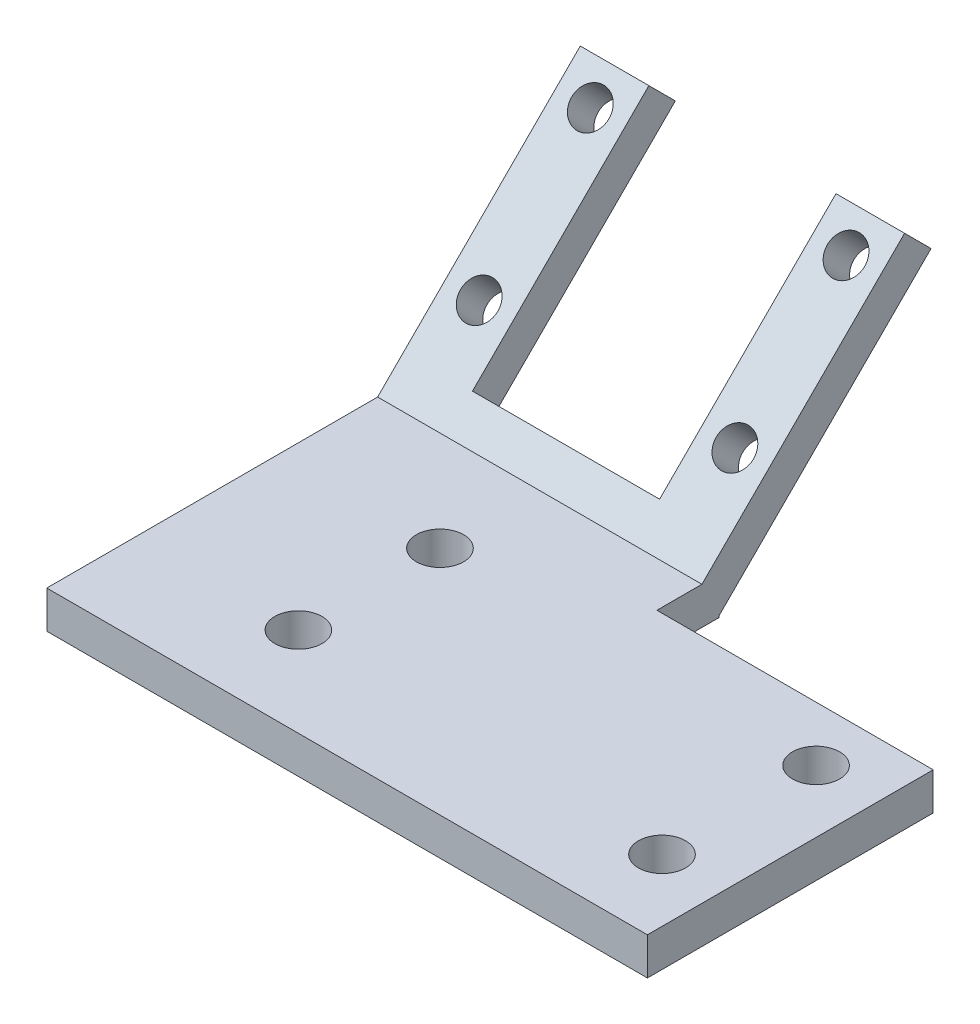
ISO-10303-21;
HEADER;
FILE_DESCRIPTION(('STEP AP214'),'2;1');
FILE_NAME('part.step','',(''),(''),'','','');
FILE_SCHEMA(('AUTOMOTIVE_DESIGN { 1 0 10303 214 1 1 1 1 }'));
ENDSEC;
DATA;
#1=APPLICATION_CONTEXT('core data for automotive mechanical design processes');
#2=APPLICATION_PROTOCOL_DEFINITION('international standard','automotive_design',2000,#1);
#3=PRODUCT_CONTEXT('',#1,'mechanical');
#4=PRODUCT('Part','Part','',(#3));
#5=PRODUCT_RELATED_PRODUCT_CATEGORY('part','',(#4));
#6=PRODUCT_DEFINITION_FORMATION('','',#4);
#7=PRODUCT_DEFINITION_CONTEXT('part definition',#1,'design');
#8=PRODUCT_DEFINITION('design','',#6,#7);
#9=PRODUCT_DEFINITION_SHAPE('','',#8);
#10=(LENGTH_UNIT() NAMED_UNIT(*) SI_UNIT(.MILLI.,.METRE.));
#11=(NAMED_UNIT(*) PLANE_ANGLE_UNIT() SI_UNIT($,.RADIAN.));
#12=(NAMED_UNIT(*) SI_UNIT($,.STERADIAN.) SOLID_ANGLE_UNIT());
#13=UNCERTAINTY_MEASURE_WITH_UNIT(LENGTH_MEASURE(1.E-05),#10,'distance_accuracy_value','');
#14=(GEOMETRIC_REPRESENTATION_CONTEXT(3) GLOBAL_UNCERTAINTY_ASSIGNED_CONTEXT((#13)) GLOBAL_UNIT_ASSIGNED_CONTEXT((#10,
#11,#12)) REPRESENTATION_CONTEXT('',''));
#15=CARTESIAN_POINT('',(0.,0.,0.));
#16=DIRECTION('',(0.,0.,1.));
#17=DIRECTION('',(1.,0.,0.));
#18=AXIS2_PLACEMENT_3D('',#15,#16,#17);
#19=CARTESIAN_POINT('',(0.,3.,0.));
#20=DIRECTION('',(0.,1.,0.));
#21=DIRECTION('',(0.,0.,1.));
#22=AXIS2_PLACEMENT_3D('',#19,#20,#21);
#23=PLANE('',#22);
#24=DIRECTION('',(0.,0.,1.));
#25=VECTOR('',#24,1.);
#26=CARTESIAN_POINT('',(-2.075,3.,-11.175));
#27=LINE('',#26,#25);
#28=CARTESIAN_POINT('',(-2.075,3.,-11.175));
#29=VERTEX_POINT('',#28);
#30=CARTESIAN_POINT('',(-2.075,3.,-7.56578301084268));
#31=VERTEX_POINT('',#30);
#32=EDGE_CURVE('E337',#29,#31,#27,.T.);
#33=ORIENTED_EDGE('',*,*,#32,.F.);
#34=DIRECTION('',(-1.,0.,0.));
#35=VECTOR('',#34,1.);
#36=CARTESIAN_POINT('',(-28.075,3.,-11.175));
#37=LINE('',#36,#35);
#38=CARTESIAN_POINT('',(-28.075,3.,-11.175));
#39=VERTEX_POINT('',#38);
#40=EDGE_CURVE('E122',#29,#39,#37,.T.);
#41=ORIENTED_EDGE('',*,*,#40,.T.);
#42=DIRECTION('',(0.,0.,1.));
#43=VECTOR('',#42,1.);
#44=CARTESIAN_POINT('',(-28.075,3.,-11.175));
#45=LINE('',#44,#43);
#46=CARTESIAN_POINT('',(-28.075,3.,15.3459017592082));
#47=VERTEX_POINT('',#46);
#48=EDGE_CURVE('E117',#39,#47,#45,.T.);
#49=ORIENTED_EDGE('',*,*,#48,.T.);
#50=DIRECTION('',(1.,0.,0.));
#51=VECTOR('',#50,1.);
#52=CARTESIAN_POINT('',(-28.075,3.,15.3459017592082));
#53=LINE('',#52,#51);
#54=CARTESIAN_POINT('',(20.075,3.,15.3459017592082));
#55=VERTEX_POINT('',#54);
#56=EDGE_CURVE('E108',#47,#55,#53,.T.);
#57=ORIENTED_EDGE('',*,*,#56,.T.);
#58=DIRECTION('',(0.,0.,-1.));
#59=VECTOR('',#58,1.);
#60=CARTESIAN_POINT('',(20.075,3.,-11.175));
#61=LINE('',#60,#59);
#62=CARTESIAN_POINT('',(20.075,3.,-7.56578301084268));
#63=VERTEX_POINT('',#62);
#64=EDGE_CURVE('E116',#55,#63,#61,.T.);
#65=ORIENTED_EDGE('',*,*,#64,.T.);
#66=DIRECTION('',(1.,0.,0.));
#67=VECTOR('',#66,1.);
#68=CARTESIAN_POINT('',(-2.075,3.,-7.56578301084268));
#69=LINE('',#68,#67);
#70=EDGE_CURVE('E333',#31,#63,#69,.T.);
#71=ORIENTED_EDGE('',*,*,#70,.F.);
#72=EDGE_LOOP('',(#33,#41,#49,#57,#65,#71));
#73=FACE_BOUND('',#72,.T.);
#74=CARTESIAN_POINT('',(15.075,3.,9.175));
#75=DIRECTION('',(0.,1.,0.));
#76=DIRECTION('',(0.,0.,1.));
#77=AXIS2_PLACEMENT_3D('',#74,#75,#76);
#78=CIRCLE('',#77,1.89);
#79=CARTESIAN_POINT('',(15.075,3.,11.065));
#80=VERTEX_POINT('',#79);
#81=EDGE_CURVE('E191',#80,#80,#78,.T.);
#82=ORIENTED_EDGE('',*,*,#81,.F.);
#83=EDGE_LOOP('',(#82));
#84=FACE_BOUND('',#83,.T.);
#85=CARTESIAN_POINT('',(-15.075,3.,8.175));
#86=DIRECTION('',(0.,1.,0.));
#87=DIRECTION('',(0.,0.,1.));
#88=AXIS2_PLACEMENT_3D('',#85,#86,#87);
#89=CIRCLE('',#88,1.89);
#90=CARTESIAN_POINT('',(-15.075,3.,10.065));
#91=VERTEX_POINT('',#90);
#92=EDGE_CURVE('E176',#91,#91,#89,.T.);
#93=ORIENTED_EDGE('',*,*,#92,.F.);
#94=EDGE_LOOP('',(#93));
#95=FACE_BOUND('',#94,.T.);
#96=CARTESIAN_POINT('',(-15.075,3.,-3.175));
#97=DIRECTION('',(0.,1.,0.));
#98=DIRECTION('',(0.,0.,1.));
#99=AXIS2_PLACEMENT_3D('',#96,#97,#98);
#100=CIRCLE('',#99,1.89);
#101=CARTESIAN_POINT('',(-15.075,3.,-1.285));
#102=VERTEX_POINT('',#101);
#103=EDGE_CURVE('E184',#102,#102,#100,.T.);
#104=ORIENTED_EDGE('',*,*,#103,.F.);
#105=EDGE_LOOP('',(#104));
#106=FACE_BOUND('',#105,.T.);
#107=CARTESIAN_POINT('',(15.075,3.,-3.175));
#108=DIRECTION('',(0.,1.,0.));
#109=DIRECTION('',(0.,0.,1.));
#110=AXIS2_PLACEMENT_3D('',#107,#108,#109);
#111=CIRCLE('',#110,1.89);
#112=CARTESIAN_POINT('',(15.075,3.,-1.285));
#113=VERTEX_POINT('',#112);
#114=EDGE_CURVE('E199',#113,#113,#111,.T.);
#115=ORIENTED_EDGE('',*,*,#114,.F.);
#116=EDGE_LOOP('',(#115));
#117=FACE_BOUND('',#116,.T.);
#118=ADVANCED_FACE('F40',(#73,#84,#95,#106,#117),#23,.T.);
#119=CARTESIAN_POINT('',(0.,0.,0.));
#120=DIRECTION('',(0.,1.,0.));
#121=DIRECTION('',(0.,0.,1.));
#122=AXIS2_PLACEMENT_3D('',#119,#120,#121);
#123=PLANE('',#122);
#124=DIRECTION('',(0.,0.,1.));
#125=VECTOR('',#124,1.);
#126=CARTESIAN_POINT('',(-2.075,0.,-10.1692123375374));
#127=LINE('',#126,#125);
#128=CARTESIAN_POINT('',(-2.075,0.,-12.5463203435596));
#129=VERTEX_POINT('',#128);
#130=CARTESIAN_POINT('',(-2.075,0.,-7.56578301084268));
#131=VERTEX_POINT('',#130);
#132=EDGE_CURVE('E315',#129,#131,#127,.T.);
#133=ORIENTED_EDGE('',*,*,#132,.T.);
#134=DIRECTION('',(1.,0.,0.));
#135=VECTOR('',#134,1.);
#136=CARTESIAN_POINT('',(-2.075,0.,-7.56578301084268));
#137=LINE('',#136,#135);
#138=CARTESIAN_POINT('',(20.075,0.,-7.56578301084268));
#139=VERTEX_POINT('',#138);
#140=EDGE_CURVE('E330',#131,#139,#137,.T.);
#141=ORIENTED_EDGE('',*,*,#140,.T.);
#142=DIRECTION('',(0.,0.,-1.));
#143=VECTOR('',#142,1.);
#144=CARTESIAN_POINT('',(20.075,0.,-11.175));
#145=LINE('',#144,#143);
#146=CARTESIAN_POINT('',(20.075,0.,15.3459017592082));
#147=VERTEX_POINT('',#146);
#148=EDGE_CURVE('E124',#147,#139,#145,.T.);
#149=ORIENTED_EDGE('',*,*,#148,.F.);
#150=DIRECTION('',(1.,0.,0.));
#151=VECTOR('',#150,1.);
#152=CARTESIAN_POINT('',(-28.075,0.,15.3459017592082));
#153=LINE('',#152,#151);
#154=CARTESIAN_POINT('',(-28.075,0.,15.3459017592082));
#155=VERTEX_POINT('',#154);
#156=EDGE_CURVE('E165',#155,#147,#153,.T.);
#157=ORIENTED_EDGE('',*,*,#156,.F.);
#158=DIRECTION('',(0.,0.,1.));
#159=VECTOR('',#158,1.);
#160=CARTESIAN_POINT('',(-28.075,0.,-11.175));
#161=LINE('',#160,#159);
#162=CARTESIAN_POINT('',(-28.075,0.,-12.5463203435596));
#163=VERTEX_POINT('',#162);
#164=EDGE_CURVE('E71',#163,#155,#161,.T.);
#165=ORIENTED_EDGE('',*,*,#164,.F.);
#166=DIRECTION('',(1.,0.,0.));
#167=VECTOR('',#166,1.);
#168=CARTESIAN_POINT('',(-28.075,0.,-12.5463203435596));
#169=LINE('',#168,#167);
#170=EDGE_CURVE('E322',#163,#129,#169,.T.);
#171=ORIENTED_EDGE('',*,*,#170,.T.);
#172=EDGE_LOOP('',(#133,#141,#149,#157,#165,#171));
#173=FACE_BOUND('',#172,.T.);
#174=CARTESIAN_POINT('',(-15.075,0.,8.175));
#175=DIRECTION('',(0.,1.,0.));
#176=DIRECTION('',(0.,0.,1.));
#177=AXIS2_PLACEMENT_3D('',#174,#175,#176);
#178=CIRCLE('',#177,1.89);
#179=CARTESIAN_POINT('',(-15.075,0.,10.065));
#180=VERTEX_POINT('',#179);
#181=EDGE_CURVE('E179',#180,#180,#178,.T.);
#182=ORIENTED_EDGE('',*,*,#181,.T.);
#183=EDGE_LOOP('',(#182));
#184=FACE_BOUND('',#183,.T.);
#185=CARTESIAN_POINT('',(-15.075,0.,-3.175));
#186=DIRECTION('',(0.,1.,0.));
#187=DIRECTION('',(0.,0.,1.));
#188=AXIS2_PLACEMENT_3D('',#185,#186,#187);
#189=CIRCLE('',#188,1.89);
#190=CARTESIAN_POINT('',(-15.075,0.,-1.285));
#191=VERTEX_POINT('',#190);
#192=EDGE_CURVE('E187',#191,#191,#189,.T.);
#193=ORIENTED_EDGE('',*,*,#192,.T.);
#194=EDGE_LOOP('',(#193));
#195=FACE_BOUND('',#194,.T.);
#196=CARTESIAN_POINT('',(15.075,0.,9.175));
#197=DIRECTION('',(0.,1.,0.));
#198=DIRECTION('',(0.,0.,1.));
#199=AXIS2_PLACEMENT_3D('',#196,#197,#198);
#200=CIRCLE('',#199,1.89);
#201=CARTESIAN_POINT('',(15.075,0.,11.065));
#202=VERTEX_POINT('',#201);
#203=EDGE_CURVE('E195',#202,#202,#200,.T.);
#204=ORIENTED_EDGE('',*,*,#203,.T.);
#205=EDGE_LOOP('',(#204));
#206=FACE_BOUND('',#205,.T.);
#207=CARTESIAN_POINT('',(15.075,0.,-3.175));
#208=DIRECTION('',(0.,1.,0.));
#209=DIRECTION('',(0.,0.,1.));
#210=AXIS2_PLACEMENT_3D('',#207,#208,#209);
#211=CIRCLE('',#210,1.89);
#212=CARTESIAN_POINT('',(15.075,0.,-1.285));
#213=VERTEX_POINT('',#212);
#214=EDGE_CURVE('E203',#213,#213,#211,.T.);
#215=ORIENTED_EDGE('',*,*,#214,.T.);
#216=EDGE_LOOP('',(#215));
#217=FACE_BOUND('',#216,.T.);
#218=ADVANCED_FACE('F127',(#173,#184,#195,#206,#217),#123,.F.);
#219=CARTESIAN_POINT('',(-28.075,3.,-11.175));
#220=DIRECTION('',(1.,0.,0.));
#221=DIRECTION('',(0.,0.,-1.));
#222=AXIS2_PLACEMENT_3D('',#219,#220,#221);
#223=PLANE('',#222);
#224=ORIENTED_EDGE('',*,*,#164,.T.);
#225=DIRECTION('',(0.,-1.,0.));
#226=VECTOR('',#225,1.);
#227=CARTESIAN_POINT('',(-28.075,3.,15.3459017592082));
#228=LINE('',#227,#226);
#229=EDGE_CURVE('E11',#47,#155,#228,.T.);
#230=ORIENTED_EDGE('',*,*,#229,.F.);
#231=ORIENTED_EDGE('',*,*,#48,.F.);
#232=DIRECTION('',(0.,0.707106781186544,-0.707106781186551));
#233=VECTOR('',#232,1.);
#234=CARTESIAN_POINT('',(-28.075,-4.08749999999999,-4.08749999999995));
#235=LINE('',#234,#233);
#236=CARTESIAN_POINT('',(-28.075,19.247023779156,-27.4220237791561));
#237=VERTEX_POINT('',#236);
#238=EDGE_CURVE('E58',#39,#237,#235,.T.);
#239=ORIENTED_EDGE('',*,*,#238,.T.);
#240=DIRECTION('',(0.,0.707106781186551,0.707106781186544));
#241=VECTOR('',#240,1.);
#242=CARTESIAN_POINT('',(-28.075,17.1257034355963,-29.5433441227158));
#243=LINE('',#242,#241);
#244=CARTESIAN_POINT('',(-28.075,17.1257034355963,-29.5433441227158));
#245=VERTEX_POINT('',#244);
#246=EDGE_CURVE('E227',#245,#237,#243,.T.);
#247=ORIENTED_EDGE('',*,*,#246,.F.);
#248=DIRECTION('',(0.,0.707106781186544,-0.707106781186551));
#249=VECTOR('',#248,1.);
#250=CARTESIAN_POINT('',(-28.075,-6.20882034355964,-6.20882034355957));
#251=LINE('',#250,#249);
#252=CARTESIAN_POINT('',(-28.075,0.128679656440357,-12.5463203435596));
#253=VERTEX_POINT('',#252);
#254=EDGE_CURVE('E81',#253,#245,#251,.T.);
#255=ORIENTED_EDGE('',*,*,#254,.F.);
#256=DIRECTION('',(0.,-1.,0.));
#257=VECTOR('',#256,1.);
#258=CARTESIAN_POINT('',(-28.075,2.,-12.5463203435596));
#259=LINE('',#258,#257);
#260=EDGE_CURVE('E312',#253,#163,#259,.T.);
#261=ORIENTED_EDGE('',*,*,#260,.T.);
#262=EDGE_LOOP('',(#224,#230,#231,#239,#247,#255,#261));
#263=FACE_BOUND('',#262,.T.);
#264=ADVANCED_FACE('F42',(#263),#223,.F.);
#265=CARTESIAN_POINT('',(-28.075,3.,15.3459017592082));
#266=DIRECTION('',(0.,0.,-1.));
#267=DIRECTION('',(-1.,0.,0.));
#268=AXIS2_PLACEMENT_3D('',#265,#266,#267);
#269=PLANE('',#268);
#270=ORIENTED_EDGE('',*,*,#156,.T.);
#271=DIRECTION('',(0.,-1.,0.));
#272=VECTOR('',#271,1.);
#273=CARTESIAN_POINT('',(20.075,3.,15.3459017592082));
#274=LINE('',#273,#272);
#275=EDGE_CURVE('E50',#55,#147,#274,.T.);
#276=ORIENTED_EDGE('',*,*,#275,.F.);
#277=ORIENTED_EDGE('',*,*,#56,.F.);
#278=ORIENTED_EDGE('',*,*,#229,.T.);
#279=EDGE_LOOP('',(#270,#276,#277,#278));
#280=FACE_BOUND('',#279,.T.);
#281=ADVANCED_FACE('F110',(#280),#269,.F.);
#282=CARTESIAN_POINT('',(20.075,3.,-11.175));
#283=DIRECTION('',(-1.,0.,0.));
#284=DIRECTION('',(0.,0.,1.));
#285=AXIS2_PLACEMENT_3D('',#282,#283,#284);
#286=PLANE('',#285);
#287=ORIENTED_EDGE('',*,*,#148,.T.);
#288=DIRECTION('',(0.,1.,0.));
#289=VECTOR('',#288,1.);
#290=CARTESIAN_POINT('',(20.075,0.,-7.56578301084268));
#291=LINE('',#290,#289);
#292=EDGE_CURVE('E159',#139,#63,#291,.T.);
#293=ORIENTED_EDGE('',*,*,#292,.T.);
#294=ORIENTED_EDGE('',*,*,#64,.F.);
#295=ORIENTED_EDGE('',*,*,#275,.T.);
#296=EDGE_LOOP('',(#287,#293,#294,#295));
#297=FACE_BOUND('',#296,.T.);
#298=ADVANCED_FACE('F132',(#297),#286,.F.);
#299=CARTESIAN_POINT('',(-15.075,3.,8.175));
#300=DIRECTION('',(0.,-1.,0.));
#301=DIRECTION('',(0.,0.,-1.));
#302=AXIS2_PLACEMENT_3D('',#299,#300,#301);
#303=CYLINDRICAL_SURFACE('',#302,1.89);
#304=ORIENTED_EDGE('',*,*,#92,.T.);
#305=EDGE_LOOP('',(#304));
#306=FACE_BOUND('',#305,.T.);
#307=ORIENTED_EDGE('',*,*,#181,.F.);
#308=EDGE_LOOP('',(#307));
#309=FACE_BOUND('',#308,.T.);
#310=ADVANCED_FACE('F142',(#306,#309),#303,.F.);
#311=CARTESIAN_POINT('',(-15.075,3.,-3.175));
#312=DIRECTION('',(0.,-1.,0.));
#313=DIRECTION('',(0.,0.,-1.));
#314=AXIS2_PLACEMENT_3D('',#311,#312,#313);
#315=CYLINDRICAL_SURFACE('',#314,1.89);
#316=ORIENTED_EDGE('',*,*,#103,.T.);
#317=EDGE_LOOP('',(#316));
#318=FACE_BOUND('',#317,.T.);
#319=ORIENTED_EDGE('',*,*,#192,.F.);
#320=EDGE_LOOP('',(#319));
#321=FACE_BOUND('',#320,.T.);
#322=ADVANCED_FACE('F151',(#318,#321),#315,.F.);
#323=CARTESIAN_POINT('',(15.075,3.,9.175));
#324=DIRECTION('',(0.,-1.,0.));
#325=DIRECTION('',(0.,0.,-1.));
#326=AXIS2_PLACEMENT_3D('',#323,#324,#325);
#327=CYLINDRICAL_SURFACE('',#326,1.89);
#328=ORIENTED_EDGE('',*,*,#81,.T.);
#329=EDGE_LOOP('',(#328));
#330=FACE_BOUND('',#329,.T.);
#331=ORIENTED_EDGE('',*,*,#203,.F.);
#332=EDGE_LOOP('',(#331));
#333=FACE_BOUND('',#332,.T.);
#334=ADVANCED_FACE('F444',(#330,#333),#327,.F.);
#335=CARTESIAN_POINT('',(15.075,3.,-3.175));
#336=DIRECTION('',(0.,-1.,0.));
#337=DIRECTION('',(0.,0.,-1.));
#338=AXIS2_PLACEMENT_3D('',#335,#336,#337);
#339=CYLINDRICAL_SURFACE('',#338,1.89);
#340=ORIENTED_EDGE('',*,*,#114,.T.);
#341=EDGE_LOOP('',(#340));
#342=FACE_BOUND('',#341,.T.);
#343=ORIENTED_EDGE('',*,*,#214,.F.);
#344=EDGE_LOOP('',(#343));
#345=FACE_BOUND('',#344,.T.);
#346=ADVANCED_FACE('F413',(#342,#345),#339,.F.);
#347=CARTESIAN_POINT('',(-2.075,-6.20882034355964,-6.20882034355957));
#348=DIRECTION('',(1.,0.,0.));
#349=DIRECTION('',(0.,0.,-1.));
#350=AXIS2_PLACEMENT_3D('',#347,#348,#349);
#351=PLANE('',#350);
#352=DIRECTION('',(0.,-1.,0.));
#353=VECTOR('',#352,1.);
#354=CARTESIAN_POINT('',(-2.075,2.,-12.5463203435596));
#355=LINE('',#354,#353);
#356=CARTESIAN_POINT('',(-2.075,0.128679656440358,-12.5463203435596));
#357=VERTEX_POINT('',#356);
#358=EDGE_CURVE('E270',#357,#129,#355,.T.);
#359=ORIENTED_EDGE('',*,*,#358,.F.);
#360=DIRECTION('',(0.,0.707106781186544,-0.707106781186551));
#361=VECTOR('',#360,1.);
#362=CARTESIAN_POINT('',(-2.075,-6.20882034355964,-6.20882034355957));
#363=LINE('',#362,#361);
#364=CARTESIAN_POINT('',(-2.075,17.1257034355963,-29.5433441227158));
#365=VERTEX_POINT('',#364);
#366=EDGE_CURVE('E277',#357,#365,#363,.T.);
#367=ORIENTED_EDGE('',*,*,#366,.T.);
#368=DIRECTION('',(0.,0.707106781186551,0.707106781186544));
#369=VECTOR('',#368,1.);
#370=CARTESIAN_POINT('',(-2.075,17.1257034355963,-29.5433441227158));
#371=LINE('',#370,#369);
#372=CARTESIAN_POINT('',(-2.075,19.247023779156,-27.4220237791561));
#373=VERTEX_POINT('',#372);
#374=EDGE_CURVE('E223',#365,#373,#371,.T.);
#375=ORIENTED_EDGE('',*,*,#374,.T.);
#376=DIRECTION('',(0.,0.707106781186544,-0.707106781186551));
#377=VECTOR('',#376,1.);
#378=CARTESIAN_POINT('',(-2.075,-4.08749999999999,-4.08749999999994));
#379=LINE('',#378,#377);
#380=EDGE_CURVE('E234',#29,#373,#379,.T.);
#381=ORIENTED_EDGE('',*,*,#380,.F.);
#382=ORIENTED_EDGE('',*,*,#32,.T.);
#383=DIRECTION('',(0.,1.,0.));
#384=VECTOR('',#383,1.);
#385=CARTESIAN_POINT('',(-2.075,0.,-7.56578301084268));
#386=LINE('',#385,#384);
#387=EDGE_CURVE('E326',#131,#31,#386,.T.);
#388=ORIENTED_EDGE('',*,*,#387,.F.);
#389=ORIENTED_EDGE('',*,*,#132,.F.);
#390=EDGE_LOOP('',(#359,#367,#375,#381,#382,#388,#389));
#391=FACE_BOUND('',#390,.T.);
#392=ADVANCED_FACE('F383',(#391),#351,.T.);
#393=CARTESIAN_POINT('',(0.,-4.08749999999999,-4.08749999999994));
#394=DIRECTION('',(0.,-0.707106781186551,-0.707106781186544));
#395=DIRECTION('',(0.,0.707106781186544,-0.707106781186551));
#396=AXIS2_PLACEMENT_3D('',#393,#394,#395);
#397=PLANE('',#396);
#398=CARTESIAN_POINT('',(-25.325,8.39293468794251,-16.5679346879426));
#399=DIRECTION('',(0.,-0.707106781186551,-0.707106781186544));
#400=DIRECTION('',(0.,0.707106781186544,-0.707106781186551));
#401=AXIS2_PLACEMENT_3D('',#398,#399,#400);
#402=CIRCLE('',#401,1.5);
#403=CARTESIAN_POINT('',(-25.325,9.45359485972233,-17.6285948597224));
#404=VERTEX_POINT('',#403);
#405=EDGE_CURVE('E266',#404,#404,#402,.T.);
#406=ORIENTED_EDGE('',*,*,#405,.T.);
#407=EDGE_LOOP('',(#406));
#408=FACE_BOUND('',#407,.T.);
#409=CARTESIAN_POINT('',(-4.825,8.39293468794251,-16.5679346879426));
#410=DIRECTION('',(0.,-0.707106781186551,-0.707106781186544));
#411=DIRECTION('',(0.,0.707106781186544,-0.707106781186551));
#412=AXIS2_PLACEMENT_3D('',#409,#410,#411);
#413=CIRCLE('',#412,1.5);
#414=CARTESIAN_POINT('',(-4.825,9.45359485972233,-17.6285948597224));
#415=VERTEX_POINT('',#414);
#416=EDGE_CURVE('E262',#415,#415,#413,.T.);
#417=ORIENTED_EDGE('',*,*,#416,.T.);
#418=EDGE_LOOP('',(#417));
#419=FACE_BOUND('',#418,.T.);
#420=CARTESIAN_POINT('',(-25.325,17.302480130893,-25.4774801308931));
#421=DIRECTION('',(0.,-0.707106781186551,-0.707106781186544));
#422=DIRECTION('',(0.,0.707106781186544,-0.707106781186551));
#423=AXIS2_PLACEMENT_3D('',#420,#421,#422);
#424=CIRCLE('',#423,1.5);
#425=CARTESIAN_POINT('',(-25.325,18.3631403026728,-26.5381403026729));
#426=VERTEX_POINT('',#425);
#427=EDGE_CURVE('E258',#426,#426,#424,.T.);
#428=ORIENTED_EDGE('',*,*,#427,.T.);
#429=EDGE_LOOP('',(#428));
#430=FACE_BOUND('',#429,.T.);
#431=CARTESIAN_POINT('',(-4.825,17.302480130893,-25.4774801308931));
#432=DIRECTION('',(0.,-0.707106781186551,-0.707106781186544));
#433=DIRECTION('',(0.,0.707106781186544,-0.707106781186551));
#434=AXIS2_PLACEMENT_3D('',#431,#432,#433);
#435=CIRCLE('',#434,1.5);
#436=CARTESIAN_POINT('',(-4.825,18.3631403026728,-26.5381403026729));
#437=VERTEX_POINT('',#436);
#438=EDGE_CURVE('E254',#437,#437,#435,.T.);
#439=ORIENTED_EDGE('',*,*,#438,.T.);
#440=EDGE_LOOP('',(#439));
#441=FACE_BOUND('',#440,.T.);
#442=ORIENTED_EDGE('',*,*,#238,.F.);
#443=ORIENTED_EDGE('',*,*,#40,.F.);
#444=ORIENTED_EDGE('',*,*,#380,.T.);
#445=DIRECTION('',(1.,0.,0.));
#446=VECTOR('',#445,1.);
#447=CARTESIAN_POINT('',(0.,19.247023779156,-27.4220237791561));
#448=LINE('',#447,#446);
#449=CARTESIAN_POINT('',(-7.575,19.247023779156,-27.4220237791561));
#450=VERTEX_POINT('',#449);
#451=EDGE_CURVE('E237',#450,#373,#448,.T.);
#452=ORIENTED_EDGE('',*,*,#451,.F.);
#453=DIRECTION('',(0.,-0.707106781186544,0.707106781186551));
#454=VECTOR('',#453,1.);
#455=CARTESIAN_POINT('',(-7.575,-4.08749999999999,-4.08749999999995));
#456=LINE('',#455,#454);
#457=CARTESIAN_POINT('',(-7.575,5.10488815542508,-13.2798881554251));
#458=VERTEX_POINT('',#457);
#459=EDGE_CURVE('E238',#450,#458,#456,.T.);
#460=ORIENTED_EDGE('',*,*,#459,.T.);
#461=DIRECTION('',(-1.,0.,0.));
#462=VECTOR('',#461,1.);
#463=CARTESIAN_POINT('',(0.,5.10488815542508,-13.2798881554251));
#464=LINE('',#463,#462);
#465=CARTESIAN_POINT('',(-22.575,5.10488815542508,-13.2798881554251));
#466=VERTEX_POINT('',#465);
#467=EDGE_CURVE('E242',#458,#466,#464,.T.);
#468=ORIENTED_EDGE('',*,*,#467,.T.);
#469=DIRECTION('',(0.,-0.707106781186544,0.707106781186551));
#470=VECTOR('',#469,1.);
#471=CARTESIAN_POINT('',(-22.575,-4.08749999999999,-4.08749999999995));
#472=LINE('',#471,#470);
#473=CARTESIAN_POINT('',(-22.575,19.247023779156,-27.4220237791561));
#474=VERTEX_POINT('',#473);
#475=EDGE_CURVE('E246',#474,#466,#472,.T.);
#476=ORIENTED_EDGE('',*,*,#475,.F.);
#477=EDGE_CURVE('E250',#237,#474,#448,.T.);
#478=ORIENTED_EDGE('',*,*,#477,.F.);
#479=EDGE_LOOP('',(#442,#443,#444,#452,#460,#468,#476,#478));
#480=FACE_BOUND('',#479,.T.);
#481=ADVANCED_FACE('F401',(#408,#419,#430,#441,#480),#397,.F.);
#482=CARTESIAN_POINT('',(0.,17.1257034355963,-29.5433441227158));
#483=DIRECTION('',(0.,-0.707106781186544,0.707106781186551));
#484=DIRECTION('',(0.,-0.707106781186551,-0.707106781186544));
#485=AXIS2_PLACEMENT_3D('',#482,#483,#484);
#486=PLANE('',#485);
#487=ORIENTED_EDGE('',*,*,#477,.T.);
#488=DIRECTION('',(0.,0.707106781186551,0.707106781186544));
#489=VECTOR('',#488,1.);
#490=CARTESIAN_POINT('',(-22.575,17.1257034355963,-29.5433441227158));
#491=LINE('',#490,#489);
#492=CARTESIAN_POINT('',(-22.575,17.1257034355963,-29.5433441227158));
#493=VERTEX_POINT('',#492);
#494=EDGE_CURVE('E207',#493,#474,#491,.T.);
#495=ORIENTED_EDGE('',*,*,#494,.F.);
#496=DIRECTION('',(1.,0.,0.));
#497=VECTOR('',#496,1.);
#498=CARTESIAN_POINT('',(0.,17.1257034355963,-29.5433441227158));
#499=LINE('',#498,#497);
#500=EDGE_CURVE('E294',#245,#493,#499,.T.);
#501=ORIENTED_EDGE('',*,*,#500,.F.);
#502=ORIENTED_EDGE('',*,*,#246,.T.);
#503=EDGE_LOOP('',(#487,#495,#501,#502));
#504=FACE_BOUND('',#503,.T.);
#505=ADVANCED_FACE('F391',(#504),#486,.F.);
#506=CARTESIAN_POINT('',(-22.575,-6.20882034355964,-6.20882034355957));
#507=DIRECTION('',(-1.,0.,0.));
#508=DIRECTION('',(0.,0.,1.));
#509=AXIS2_PLACEMENT_3D('',#506,#507,#508);
#510=PLANE('',#509);
#511=ORIENTED_EDGE('',*,*,#475,.T.);
#512=DIRECTION('',(0.,0.707106781186551,0.707106781186544));
#513=VECTOR('',#512,1.);
#514=CARTESIAN_POINT('',(-22.575,2.98356781186543,-15.4012084989847));
#515=LINE('',#514,#513);
#516=CARTESIAN_POINT('',(-22.575,2.98356781186543,-15.4012084989847));
#517=VERTEX_POINT('',#516);
#518=EDGE_CURVE('E214',#517,#466,#515,.T.);
#519=ORIENTED_EDGE('',*,*,#518,.F.);
#520=DIRECTION('',(0.,-0.707106781186544,0.707106781186551));
#521=VECTOR('',#520,1.);
#522=CARTESIAN_POINT('',(-22.575,-6.20882034355964,-6.20882034355957));
#523=LINE('',#522,#521);
#524=EDGE_CURVE('E290',#493,#517,#523,.T.);
#525=ORIENTED_EDGE('',*,*,#524,.F.);
#526=ORIENTED_EDGE('',*,*,#494,.T.);
#527=EDGE_LOOP('',(#511,#519,#525,#526));
#528=FACE_BOUND('',#527,.T.);
#529=ADVANCED_FACE('F394',(#528),#510,.F.);
#530=CARTESIAN_POINT('',(0.,2.98356781186543,-15.4012084989847));
#531=DIRECTION('',(0.,0.707106781186544,-0.707106781186551));
#532=DIRECTION('',(0.,0.707106781186551,0.707106781186544));
#533=AXIS2_PLACEMENT_3D('',#530,#531,#532);
#534=PLANE('',#533);
#535=ORIENTED_EDGE('',*,*,#467,.F.);
#536=DIRECTION('',(0.,0.707106781186551,0.707106781186544));
#537=VECTOR('',#536,1.);
#538=CARTESIAN_POINT('',(-7.575,2.98356781186543,-15.4012084989847));
#539=LINE('',#538,#537);
#540=CARTESIAN_POINT('',(-7.575,2.98356781186543,-15.4012084989847));
#541=VERTEX_POINT('',#540);
#542=EDGE_CURVE('E217',#541,#458,#539,.T.);
#543=ORIENTED_EDGE('',*,*,#542,.F.);
#544=DIRECTION('',(-1.,0.,0.));
#545=VECTOR('',#544,1.);
#546=CARTESIAN_POINT('',(0.,2.98356781186543,-15.4012084989847));
#547=LINE('',#546,#545);
#548=EDGE_CURVE('E286',#541,#517,#547,.T.);
#549=ORIENTED_EDGE('',*,*,#548,.T.);
#550=ORIENTED_EDGE('',*,*,#518,.T.);
#551=EDGE_LOOP('',(#535,#543,#549,#550));
#552=FACE_BOUND('',#551,.T.);
#553=ADVANCED_FACE('F397',(#552),#534,.T.);
#554=CARTESIAN_POINT('',(-7.575,-6.20882034355964,-6.20882034355957));
#555=DIRECTION('',(-1.,0.,0.));
#556=DIRECTION('',(0.,0.,1.));
#557=AXIS2_PLACEMENT_3D('',#554,#555,#556);
#558=PLANE('',#557);
#559=ORIENTED_EDGE('',*,*,#459,.F.);
#560=DIRECTION('',(0.,0.707106781186551,0.707106781186544));
#561=VECTOR('',#560,1.);
#562=CARTESIAN_POINT('',(-7.575,17.1257034355963,-29.5433441227158));
#563=LINE('',#562,#561);
#564=CARTESIAN_POINT('',(-7.575,17.1257034355963,-29.5433441227158));
#565=VERTEX_POINT('',#564);
#566=EDGE_CURVE('E220',#565,#450,#563,.T.);
#567=ORIENTED_EDGE('',*,*,#566,.F.);
#568=DIRECTION('',(0.,-0.707106781186544,0.707106781186551));
#569=VECTOR('',#568,1.);
#570=CARTESIAN_POINT('',(-7.575,-6.20882034355964,-6.20882034355957));
#571=LINE('',#570,#569);
#572=EDGE_CURVE('E282',#565,#541,#571,.T.);
#573=ORIENTED_EDGE('',*,*,#572,.T.);
#574=ORIENTED_EDGE('',*,*,#542,.T.);
#575=EDGE_LOOP('',(#559,#567,#573,#574));
#576=FACE_BOUND('',#575,.T.);
#577=ADVANCED_FACE('F400',(#576),#558,.T.);
#578=ORIENTED_EDGE('',*,*,#451,.T.);
#579=ORIENTED_EDGE('',*,*,#374,.F.);
#580=EDGE_CURVE('E281',#565,#365,#499,.T.);
#581=ORIENTED_EDGE('',*,*,#580,.F.);
#582=ORIENTED_EDGE('',*,*,#566,.T.);
#583=EDGE_LOOP('',(#578,#579,#581,#582));
#584=FACE_BOUND('',#583,.T.);
#585=ADVANCED_FACE('F378',(#584),#486,.F.);
#586=CARTESIAN_POINT('',(-4.825,15.1811597873333,-27.5988004744527));
#587=DIRECTION('',(0.,0.707106781186551,0.707106781186544));
#588=DIRECTION('',(0.,-0.707106781186544,0.707106781186551));
#589=AXIS2_PLACEMENT_3D('',#586,#587,#588);
#590=CYLINDRICAL_SURFACE('',#589,1.5);
#591=CARTESIAN_POINT('',(-4.825,15.1811597873333,-27.5988004744527));
#592=DIRECTION('',(0.,-0.707106781186551,-0.707106781186544));
#593=DIRECTION('',(0.,0.707106781186544,-0.707106781186551));
#594=AXIS2_PLACEMENT_3D('',#591,#592,#593);
#595=CIRCLE('',#594,1.5);
#596=CARTESIAN_POINT('',(-4.825,16.2418199591131,-28.6594606462326));
#597=VERTEX_POINT('',#596);
#598=EDGE_CURVE('E297',#597,#597,#595,.T.);
#599=ORIENTED_EDGE('',*,*,#598,.T.);
#600=EDGE_LOOP('',(#599));
#601=FACE_BOUND('',#600,.T.);
#602=ORIENTED_EDGE('',*,*,#438,.F.);
#603=EDGE_LOOP('',(#602));
#604=FACE_BOUND('',#603,.T.);
#605=ADVANCED_FACE('F420',(#601,#604),#590,.F.);
#606=CARTESIAN_POINT('',(-25.325,15.1811597873333,-27.5988004744527));
#607=DIRECTION('',(0.,0.707106781186551,0.707106781186544));
#608=DIRECTION('',(0.,-0.707106781186544,0.707106781186551));
#609=AXIS2_PLACEMENT_3D('',#606,#607,#608);
#610=CYLINDRICAL_SURFACE('',#609,1.5);
#611=CARTESIAN_POINT('',(-25.325,15.1811597873333,-27.5988004744527));
#612=DIRECTION('',(0.,-0.707106781186551,-0.707106781186544));
#613=DIRECTION('',(0.,0.707106781186544,-0.707106781186551));
#614=AXIS2_PLACEMENT_3D('',#611,#612,#613);
#615=CIRCLE('',#614,1.5);
#616=CARTESIAN_POINT('',(-25.325,16.2418199591131,-28.6594606462326));
#617=VERTEX_POINT('',#616);
#618=EDGE_CURVE('E301',#617,#617,#615,.T.);
#619=ORIENTED_EDGE('',*,*,#618,.T.);
#620=EDGE_LOOP('',(#619));
#621=FACE_BOUND('',#620,.T.);
#622=ORIENTED_EDGE('',*,*,#427,.F.);
#623=EDGE_LOOP('',(#622));
#624=FACE_BOUND('',#623,.T.);
#625=ADVANCED_FACE('F429',(#621,#624),#610,.F.);
#626=CARTESIAN_POINT('',(-4.825,6.27161434438286,-18.6892550315022));
#627=DIRECTION('',(0.,0.707106781186551,0.707106781186544));
#628=DIRECTION('',(0.,-0.707106781186544,0.707106781186551));
#629=AXIS2_PLACEMENT_3D('',#626,#627,#628);
#630=CYLINDRICAL_SURFACE('',#629,1.5);
#631=CARTESIAN_POINT('',(-4.825,6.27161434438286,-18.6892550315022));
#632=DIRECTION('',(0.,-0.707106781186551,-0.707106781186544));
#633=DIRECTION('',(0.,0.707106781186544,-0.707106781186551));
#634=AXIS2_PLACEMENT_3D('',#631,#632,#633);
#635=CIRCLE('',#634,1.5);
#636=CARTESIAN_POINT('',(-4.825,7.33227451616268,-19.749915203282));
#637=VERTEX_POINT('',#636);
#638=EDGE_CURVE('E305',#637,#637,#635,.T.);
#639=ORIENTED_EDGE('',*,*,#638,.T.);
#640=EDGE_LOOP('',(#639));
#641=FACE_BOUND('',#640,.T.);
#642=ORIENTED_EDGE('',*,*,#416,.F.);
#643=EDGE_LOOP('',(#642));
#644=FACE_BOUND('',#643,.T.);
#645=ADVANCED_FACE('F433',(#641,#644),#630,.F.);
#646=CARTESIAN_POINT('',(-25.325,6.27161434438286,-18.6892550315022));
#647=DIRECTION('',(0.,0.707106781186551,0.707106781186544));
#648=DIRECTION('',(0.,-0.707106781186544,0.707106781186551));
#649=AXIS2_PLACEMENT_3D('',#646,#647,#648);
#650=CYLINDRICAL_SURFACE('',#649,1.5);
#651=CARTESIAN_POINT('',(-25.325,6.27161434438286,-18.6892550315022));
#652=DIRECTION('',(0.,-0.707106781186551,-0.707106781186544));
#653=DIRECTION('',(0.,0.707106781186544,-0.707106781186551));
#654=AXIS2_PLACEMENT_3D('',#651,#652,#653);
#655=CIRCLE('',#654,1.5);
#656=CARTESIAN_POINT('',(-25.325,7.33227451616268,-19.749915203282));
#657=VERTEX_POINT('',#656);
#658=EDGE_CURVE('E233',#657,#657,#655,.T.);
#659=ORIENTED_EDGE('',*,*,#658,.T.);
#660=EDGE_LOOP('',(#659));
#661=FACE_BOUND('',#660,.T.);
#662=ORIENTED_EDGE('',*,*,#405,.F.);
#663=EDGE_LOOP('',(#662));
#664=FACE_BOUND('',#663,.T.);
#665=ADVANCED_FACE('F437',(#661,#664),#650,.F.);
#666=CARTESIAN_POINT('',(0.,-6.20882034355964,-6.20882034355957));
#667=DIRECTION('',(0.,-0.707106781186551,-0.707106781186544));
#668=DIRECTION('',(0.,0.707106781186544,-0.707106781186551));
#669=AXIS2_PLACEMENT_3D('',#666,#667,#668);
#670=PLANE('',#669);
#671=ORIENTED_EDGE('',*,*,#658,.F.);
#672=EDGE_LOOP('',(#671));
#673=FACE_BOUND('',#672,.T.);
#674=ORIENTED_EDGE('',*,*,#638,.F.);
#675=EDGE_LOOP('',(#674));
#676=FACE_BOUND('',#675,.T.);
#677=ORIENTED_EDGE('',*,*,#618,.F.);
#678=EDGE_LOOP('',(#677));
#679=FACE_BOUND('',#678,.T.);
#680=ORIENTED_EDGE('',*,*,#598,.F.);
#681=EDGE_LOOP('',(#680));
#682=FACE_BOUND('',#681,.T.);
#683=ORIENTED_EDGE('',*,*,#500,.T.);
#684=ORIENTED_EDGE('',*,*,#524,.T.);
#685=ORIENTED_EDGE('',*,*,#548,.F.);
#686=ORIENTED_EDGE('',*,*,#572,.F.);
#687=ORIENTED_EDGE('',*,*,#580,.T.);
#688=ORIENTED_EDGE('',*,*,#366,.F.);
#689=DIRECTION('',(1.,0.,0.));
#690=VECTOR('',#689,1.);
#691=CARTESIAN_POINT('',(0.,0.128679656440358,-12.5463203435596));
#692=LINE('',#691,#690);
#693=EDGE_CURVE('E273',#253,#357,#692,.T.);
#694=ORIENTED_EDGE('',*,*,#693,.F.);
#695=ORIENTED_EDGE('',*,*,#254,.T.);
#696=EDGE_LOOP('',(#683,#684,#685,#686,#687,#688,#694,#695));
#697=FACE_BOUND('',#696,.T.);
#698=ADVANCED_FACE('F373',(#673,#676,#679,#682,#697),#670,.T.);
#699=CARTESIAN_POINT('',(-28.075,2.,-12.5463203435596));
#700=DIRECTION('',(0.,0.,-1.));
#701=DIRECTION('',(-1.,0.,0.));
#702=AXIS2_PLACEMENT_3D('',#699,#700,#701);
#703=PLANE('',#702);
#704=ORIENTED_EDGE('',*,*,#260,.F.);
#705=ORIENTED_EDGE('',*,*,#693,.T.);
#706=ORIENTED_EDGE('',*,*,#358,.T.);
#707=ORIENTED_EDGE('',*,*,#170,.F.);
#708=EDGE_LOOP('',(#704,#705,#706,#707));
#709=FACE_BOUND('',#708,.T.);
#710=ADVANCED_FACE('F387',(#709),#703,.T.);
#711=CARTESIAN_POINT('',(-2.075,0.,-7.56578301084268));
#712=DIRECTION('',(0.,0.,1.));
#713=DIRECTION('',(1.,0.,0.));
#714=AXIS2_PLACEMENT_3D('',#711,#712,#713);
#715=PLANE('',#714);
#716=ORIENTED_EDGE('',*,*,#70,.T.);
#717=ORIENTED_EDGE('',*,*,#292,.F.);
#718=ORIENTED_EDGE('',*,*,#140,.F.);
#719=ORIENTED_EDGE('',*,*,#387,.T.);
#720=EDGE_LOOP('',(#716,#717,#718,#719));
#721=FACE_BOUND('',#720,.T.);
#722=ADVANCED_FACE('F347',(#721),#715,.F.);
#723=CLOSED_SHELL('',(#118,#218,#264,#281,#298,#310,#322,#334,#346,#392,#481,#505,#529,#553,
#577,#585,#605,#625,#645,#665,#698,#710,#722));
#724=MANIFOLD_SOLID_BREP('B2',#723);
#725=ADVANCED_BREP_SHAPE_REPRESENTATION('',(#18,#724),#14);
#726=SHAPE_DEFINITION_REPRESENTATION(#9,#725);
ENDSEC;
END-ISO-10303-21;
